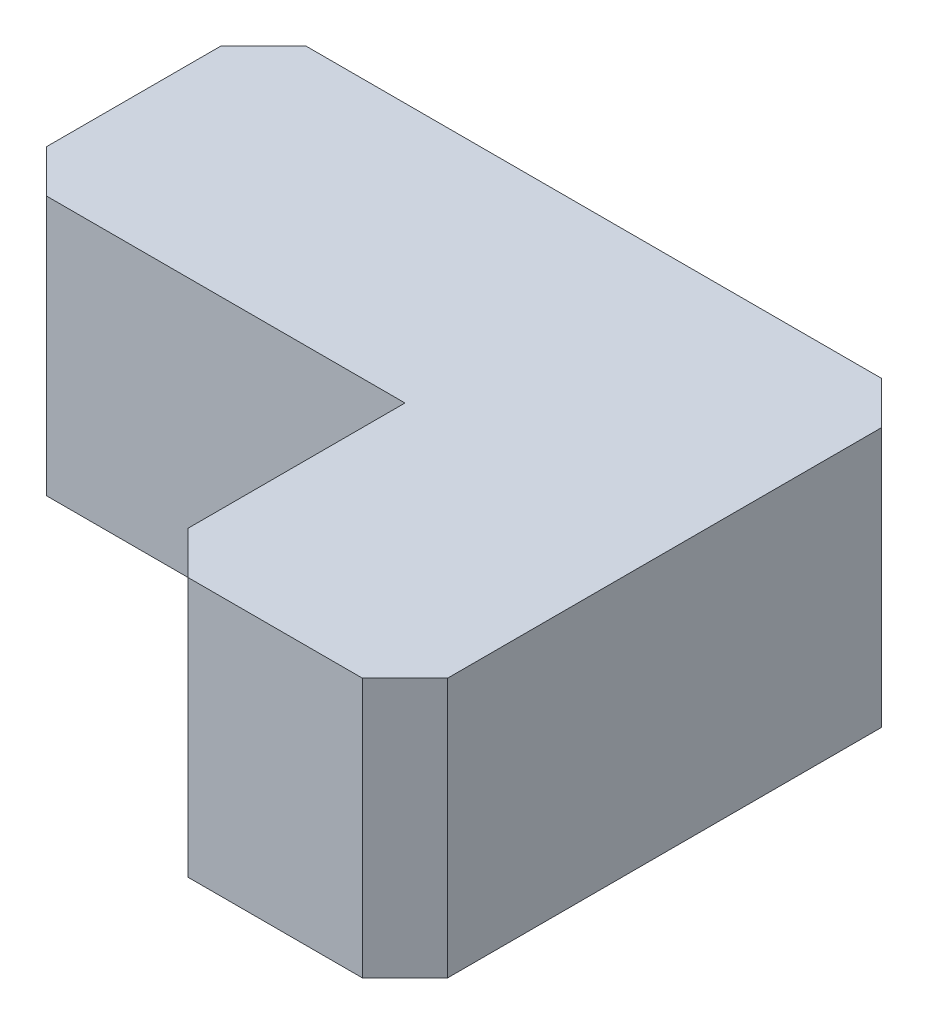
ISO-10303-21;
HEADER;
FILE_DESCRIPTION(('STEP AP214'),'2;1');
FILE_NAME('part.step','',(''),(''),'','','');
FILE_SCHEMA(('AUTOMOTIVE_DESIGN { 1 0 10303 214 1 1 1 1 }'));
ENDSEC;
DATA;
#1=APPLICATION_CONTEXT('core data for automotive mechanical design processes');
#2=APPLICATION_PROTOCOL_DEFINITION('international standard','automotive_design',2000,#1);
#3=PRODUCT_CONTEXT('',#1,'mechanical');
#4=PRODUCT('Part','Part','',(#3));
#5=PRODUCT_RELATED_PRODUCT_CATEGORY('part','',(#4));
#6=PRODUCT_DEFINITION_FORMATION('','',#4);
#7=PRODUCT_DEFINITION_CONTEXT('part definition',#1,'design');
#8=PRODUCT_DEFINITION('design','',#6,#7);
#9=PRODUCT_DEFINITION_SHAPE('','',#8);
#10=(LENGTH_UNIT() NAMED_UNIT(*) SI_UNIT(.MILLI.,.METRE.));
#11=(NAMED_UNIT(*) PLANE_ANGLE_UNIT() SI_UNIT($,.RADIAN.));
#12=(NAMED_UNIT(*) SI_UNIT($,.STERADIAN.) SOLID_ANGLE_UNIT());
#13=UNCERTAINTY_MEASURE_WITH_UNIT(LENGTH_MEASURE(1.E-05),#10,'distance_accuracy_value','');
#14=(GEOMETRIC_REPRESENTATION_CONTEXT(3) GLOBAL_UNCERTAINTY_ASSIGNED_CONTEXT((#13)) GLOBAL_UNIT_ASSIGNED_CONTEXT((#10,
#11,#12)) REPRESENTATION_CONTEXT('',''));
#15=CARTESIAN_POINT('',(0.,0.,0.));
#16=DIRECTION('',(0.,0.,1.));
#17=DIRECTION('',(1.,0.,0.));
#18=AXIS2_PLACEMENT_3D('',#15,#16,#17);
#19=CARTESIAN_POINT('',(9.,55.,0.));
#20=DIRECTION('',(0.,0.,-1.));
#21=DIRECTION('',(-1.,0.,0.));
#22=AXIS2_PLACEMENT_3D('',#19,#20,#21);
#23=PLANE('',#22);
#24=DIRECTION('',(0.,-1.,0.));
#25=VECTOR('',#24,1.);
#26=CARTESIAN_POINT('',(85.,55.,0.));
#27=LINE('',#26,#25);
#28=CARTESIAN_POINT('',(85.,55.,0.));
#29=VERTEX_POINT('',#28);
#30=CARTESIAN_POINT('',(85.,0.,0.));
#31=VERTEX_POINT('',#30);
#32=EDGE_CURVE('E140',#29,#31,#27,.T.);
#33=ORIENTED_EDGE('',*,*,#32,.F.);
#34=DIRECTION('',(1.,0.,0.));
#35=VECTOR('',#34,1.);
#36=CARTESIAN_POINT('',(9.,55.,0.));
#37=LINE('',#36,#35);
#38=CARTESIAN_POINT('',(9.,55.,0.));
#39=VERTEX_POINT('',#38);
#40=EDGE_CURVE('E583',#39,#29,#37,.T.);
#41=ORIENTED_EDGE('',*,*,#40,.F.);
#42=DIRECTION('',(0.,-1.,0.));
#43=VECTOR('',#42,1.);
#44=CARTESIAN_POINT('',(9.,55.,0.));
#45=LINE('',#44,#43);
#46=CARTESIAN_POINT('',(9.,0.,0.));
#47=VERTEX_POINT('',#46);
#48=EDGE_CURVE('E579',#39,#47,#45,.T.);
#49=ORIENTED_EDGE('',*,*,#48,.T.);
#50=DIRECTION('',(1.,0.,0.));
#51=VECTOR('',#50,1.);
#52=CARTESIAN_POINT('',(9.,0.,0.));
#53=LINE('',#52,#51);
#54=EDGE_CURVE('E577',#47,#31,#53,.T.);
#55=ORIENTED_EDGE('',*,*,#54,.T.);
#56=EDGE_LOOP('',(#33,#41,#49,#55));
#57=FACE_BOUND('',#56,.T.);
#58=ADVANCED_FACE('F44',(#57),#23,.F.);
#59=CARTESIAN_POINT('',(140.,55.,0.));
#60=DIRECTION('',(-1.,0.,0.));
#61=DIRECTION('',(0.,0.,1.));
#62=AXIS2_PLACEMENT_3D('',#59,#60,#61);
#63=PLANE('',#62);
#64=DIRECTION('',(0.,0.,-1.));
#65=VECTOR('',#64,1.);
#66=CARTESIAN_POINT('',(140.,0.,0.));
#67=LINE('',#66,#65);
#68=CARTESIAN_POINT('',(140.,0.,46.));
#69=VERTEX_POINT('',#68);
#70=CARTESIAN_POINT('',(140.,0.,-46.));
#71=VERTEX_POINT('',#70);
#72=EDGE_CURVE('E176',#69,#71,#67,.T.);
#73=ORIENTED_EDGE('',*,*,#72,.T.);
#74=DIRECTION('',(0.,-1.,0.));
#75=VECTOR('',#74,1.);
#76=CARTESIAN_POINT('',(140.,55.,-46.));
#77=LINE('',#76,#75);
#78=CARTESIAN_POINT('',(140.,55.,-46.));
#79=VERTEX_POINT('',#78);
#80=EDGE_CURVE('E210',#79,#71,#77,.T.);
#81=ORIENTED_EDGE('',*,*,#80,.F.);
#82=DIRECTION('',(0.,0.,-1.));
#83=VECTOR('',#82,1.);
#84=CARTESIAN_POINT('',(140.,55.,0.));
#85=LINE('',#84,#83);
#86=CARTESIAN_POINT('',(140.,55.,46.));
#87=VERTEX_POINT('',#86);
#88=EDGE_CURVE('E192',#87,#79,#85,.T.);
#89=ORIENTED_EDGE('',*,*,#88,.F.);
#90=DIRECTION('',(0.,-1.,0.));
#91=VECTOR('',#90,1.);
#92=CARTESIAN_POINT('',(140.,55.,46.));
#93=LINE('',#92,#91);
#94=EDGE_CURVE('E189',#87,#69,#93,.T.);
#95=ORIENTED_EDGE('',*,*,#94,.T.);
#96=EDGE_LOOP('',(#73,#81,#89,#95));
#97=FACE_BOUND('',#96,.T.);
#98=ADVANCED_FACE('F190',(#97),#63,.F.);
#99=CARTESIAN_POINT('',(131.,55.,-55.));
#100=DIRECTION('',(0.707106781186547,0.,-0.707106781186548));
#101=DIRECTION('',(-0.707106781186548,0.,-0.707106781186547));
#102=AXIS2_PLACEMENT_3D('',#99,#100,#101);
#103=PLANE('',#102);
#104=DIRECTION('',(0.707106781186548,0.,0.707106781186547));
#105=VECTOR('',#104,1.);
#106=CARTESIAN_POINT('',(131.,0.,-55.));
#107=LINE('',#106,#105);
#108=CARTESIAN_POINT('',(131.,0.,-55.));
#109=VERTEX_POINT('',#108);
#110=EDGE_CURVE('E183',#109,#71,#107,.T.);
#111=ORIENTED_EDGE('',*,*,#110,.F.);
#112=DIRECTION('',(0.,-1.,0.));
#113=VECTOR('',#112,1.);
#114=CARTESIAN_POINT('',(131.,55.,-55.));
#115=LINE('',#114,#113);
#116=CARTESIAN_POINT('',(131.,55.,-55.));
#117=VERTEX_POINT('',#116);
#118=EDGE_CURVE('E557',#117,#109,#115,.T.);
#119=ORIENTED_EDGE('',*,*,#118,.F.);
#120=DIRECTION('',(0.707106781186548,0.,0.707106781186547));
#121=VECTOR('',#120,1.);
#122=CARTESIAN_POINT('',(131.,55.,-55.));
#123=LINE('',#122,#121);
#124=EDGE_CURVE('E626',#117,#79,#123,.T.);
#125=ORIENTED_EDGE('',*,*,#124,.T.);
#126=ORIENTED_EDGE('',*,*,#80,.T.);
#127=EDGE_LOOP('',(#111,#119,#125,#126));
#128=FACE_BOUND('',#127,.T.);
#129=ADVANCED_FACE('F509',(#128),#103,.T.);
#130=CARTESIAN_POINT('',(9.,55.,-55.));
#131=DIRECTION('',(0.,0.,-1.));
#132=DIRECTION('',(-1.,0.,0.));
#133=AXIS2_PLACEMENT_3D('',#130,#131,#132);
#134=PLANE('',#133);
#135=DIRECTION('',(1.,0.,0.));
#136=VECTOR('',#135,1.);
#137=CARTESIAN_POINT('',(9.,0.,-55.));
#138=LINE('',#137,#136);
#139=CARTESIAN_POINT('',(9.,0.,-55.));
#140=VERTEX_POINT('',#139);
#141=EDGE_CURVE('E561',#140,#109,#138,.T.);
#142=ORIENTED_EDGE('',*,*,#141,.F.);
#143=DIRECTION('',(0.,-1.,0.));
#144=VECTOR('',#143,1.);
#145=CARTESIAN_POINT('',(9.,55.,-55.));
#146=LINE('',#145,#144);
#147=CARTESIAN_POINT('',(9.,55.,-55.));
#148=VERTEX_POINT('',#147);
#149=EDGE_CURVE('E589',#148,#140,#146,.T.);
#150=ORIENTED_EDGE('',*,*,#149,.F.);
#151=DIRECTION('',(1.,0.,0.));
#152=VECTOR('',#151,1.);
#153=CARTESIAN_POINT('',(9.,55.,-55.));
#154=LINE('',#153,#152);
#155=EDGE_CURVE('E623',#148,#117,#154,.T.);
#156=ORIENTED_EDGE('',*,*,#155,.T.);
#157=ORIENTED_EDGE('',*,*,#118,.T.);
#158=EDGE_LOOP('',(#142,#150,#156,#157));
#159=FACE_BOUND('',#158,.T.);
#160=ADVANCED_FACE('F500',(#159),#134,.T.);
#161=CARTESIAN_POINT('',(0.,55.,-46.));
#162=DIRECTION('',(-0.707106781186548,0.,-0.707106781186547));
#163=DIRECTION('',(-0.707106781186547,0.,0.707106781186548));
#164=AXIS2_PLACEMENT_3D('',#161,#162,#163);
#165=PLANE('',#164);
#166=DIRECTION('',(0.707106781186547,0.,-0.707106781186548));
#167=VECTOR('',#166,1.);
#168=CARTESIAN_POINT('',(0.,0.,-46.));
#169=LINE('',#168,#167);
#170=CARTESIAN_POINT('',(0.,0.,-46.));
#171=VERTEX_POINT('',#170);
#172=EDGE_CURVE('E567',#171,#140,#169,.T.);
#173=ORIENTED_EDGE('',*,*,#172,.F.);
#174=DIRECTION('',(0.,-1.,0.));
#175=VECTOR('',#174,1.);
#176=CARTESIAN_POINT('',(0.,55.,-46.));
#177=LINE('',#176,#175);
#178=CARTESIAN_POINT('',(0.,55.,-46.));
#179=VERTEX_POINT('',#178);
#180=EDGE_CURVE('E586',#179,#171,#177,.T.);
#181=ORIENTED_EDGE('',*,*,#180,.F.);
#182=DIRECTION('',(0.707106781186547,0.,-0.707106781186548));
#183=VECTOR('',#182,1.);
#184=CARTESIAN_POINT('',(0.,55.,-46.));
#185=LINE('',#184,#183);
#186=EDGE_CURVE('E620',#179,#148,#185,.T.);
#187=ORIENTED_EDGE('',*,*,#186,.T.);
#188=ORIENTED_EDGE('',*,*,#149,.T.);
#189=EDGE_LOOP('',(#173,#181,#187,#188));
#190=FACE_BOUND('',#189,.T.);
#191=ADVANCED_FACE('F491',(#190),#165,.T.);
#192=CARTESIAN_POINT('',(0.,55.,-9.));
#193=DIRECTION('',(-1.,0.,0.));
#194=DIRECTION('',(0.,0.,1.));
#195=AXIS2_PLACEMENT_3D('',#192,#193,#194);
#196=PLANE('',#195);
#197=DIRECTION('',(0.,0.,-1.));
#198=VECTOR('',#197,1.);
#199=CARTESIAN_POINT('',(0.,0.,-9.));
#200=LINE('',#199,#198);
#201=CARTESIAN_POINT('',(0.,0.,-9.));
#202=VERTEX_POINT('',#201);
#203=EDGE_CURVE('E570',#202,#171,#200,.T.);
#204=ORIENTED_EDGE('',*,*,#203,.F.);
#205=DIRECTION('',(0.,-1.,0.));
#206=VECTOR('',#205,1.);
#207=CARTESIAN_POINT('',(0.,55.,-9.));
#208=LINE('',#207,#206);
#209=CARTESIAN_POINT('',(0.,55.,-9.));
#210=VERTEX_POINT('',#209);
#211=EDGE_CURVE('E582',#210,#202,#208,.T.);
#212=ORIENTED_EDGE('',*,*,#211,.F.);
#213=DIRECTION('',(0.,0.,-1.));
#214=VECTOR('',#213,1.);
#215=CARTESIAN_POINT('',(0.,55.,-9.));
#216=LINE('',#215,#214);
#217=EDGE_CURVE('E615',#210,#179,#216,.T.);
#218=ORIENTED_EDGE('',*,*,#217,.T.);
#219=ORIENTED_EDGE('',*,*,#180,.T.);
#220=EDGE_LOOP('',(#204,#212,#218,#219));
#221=FACE_BOUND('',#220,.T.);
#222=ADVANCED_FACE('F482',(#221),#196,.T.);
#223=CARTESIAN_POINT('',(0.,55.,-9.));
#224=DIRECTION('',(0.707106781186547,0.,-0.707106781186547));
#225=DIRECTION('',(-0.707106781186548,0.,-0.707106781186548));
#226=AXIS2_PLACEMENT_3D('',#223,#224,#225);
#227=PLANE('',#226);
#228=DIRECTION('',(0.707106781186547,0.,0.707106781186547));
#229=VECTOR('',#228,1.);
#230=CARTESIAN_POINT('',(0.,0.,-9.));
#231=LINE('',#230,#229);
#232=EDGE_CURVE('E574',#202,#47,#231,.T.);
#233=ORIENTED_EDGE('',*,*,#232,.T.);
#234=ORIENTED_EDGE('',*,*,#48,.F.);
#235=DIRECTION('',(0.707106781186547,0.,0.707106781186547));
#236=VECTOR('',#235,1.);
#237=CARTESIAN_POINT('',(0.,55.,-9.));
#238=LINE('',#237,#236);
#239=EDGE_CURVE('E612',#210,#39,#238,.T.);
#240=ORIENTED_EDGE('',*,*,#239,.F.);
#241=ORIENTED_EDGE('',*,*,#211,.T.);
#242=EDGE_LOOP('',(#233,#234,#240,#241));
#243=FACE_BOUND('',#242,.T.);
#244=ADVANCED_FACE('F473',(#243),#227,.F.);
#245=CARTESIAN_POINT('',(0.,55.,0.));
#246=DIRECTION('',(0.,-1.,0.));
#247=DIRECTION('',(0.,0.,-1.));
#248=AXIS2_PLACEMENT_3D('',#245,#246,#247);
#249=PLANE('',#248);
#250=ORIENTED_EDGE('',*,*,#88,.T.);
#251=ORIENTED_EDGE('',*,*,#124,.F.);
#252=ORIENTED_EDGE('',*,*,#155,.F.);
#253=ORIENTED_EDGE('',*,*,#186,.F.);
#254=ORIENTED_EDGE('',*,*,#217,.F.);
#255=ORIENTED_EDGE('',*,*,#239,.T.);
#256=ORIENTED_EDGE('',*,*,#40,.T.);
#257=DIRECTION('',(0.,0.,1.));
#258=VECTOR('',#257,1.);
#259=CARTESIAN_POINT('',(85.,55.,0.));
#260=LINE('',#259,#258);
#261=CARTESIAN_POINT('',(85.,55.,46.));
#262=VERTEX_POINT('',#261);
#263=EDGE_CURVE('E197',#29,#262,#260,.T.);
#264=ORIENTED_EDGE('',*,*,#263,.T.);
#265=DIRECTION('',(-0.707106781186547,0.,-0.707106781186548));
#266=VECTOR('',#265,1.);
#267=CARTESIAN_POINT('',(94.,55.,55.));
#268=LINE('',#267,#266);
#269=CARTESIAN_POINT('',(94.,55.,55.));
#270=VERTEX_POINT('',#269);
#271=EDGE_CURVE('E200',#270,#262,#268,.T.);
#272=ORIENTED_EDGE('',*,*,#271,.F.);
#273=DIRECTION('',(-1.,0.,0.));
#274=VECTOR('',#273,1.);
#275=CARTESIAN_POINT('',(131.,55.,55.));
#276=LINE('',#275,#274);
#277=CARTESIAN_POINT('',(131.,55.,55.));
#278=VERTEX_POINT('',#277);
#279=EDGE_CURVE('E596',#278,#270,#276,.T.);
#280=ORIENTED_EDGE('',*,*,#279,.F.);
#281=DIRECTION('',(-0.707106781186548,0.,0.707106781186547));
#282=VECTOR('',#281,1.);
#283=CARTESIAN_POINT('',(140.,55.,46.));
#284=LINE('',#283,#282);
#285=EDGE_CURVE('E194',#87,#278,#284,.T.);
#286=ORIENTED_EDGE('',*,*,#285,.F.);
#287=EDGE_LOOP('',(#250,#251,#252,#253,#254,#255,#256,#264,#272,#280,#286));
#288=FACE_BOUND('',#287,.T.);
#289=ADVANCED_FACE('F465',(#288),#249,.F.);
#290=CARTESIAN_POINT('',(0.,0.,0.));
#291=DIRECTION('',(0.,-1.,0.));
#292=DIRECTION('',(0.,0.,-1.));
#293=AXIS2_PLACEMENT_3D('',#290,#291,#292);
#294=PLANE('',#293);
#295=ORIENTED_EDGE('',*,*,#72,.F.);
#296=DIRECTION('',(-0.707106781186548,0.,0.707106781186547));
#297=VECTOR('',#296,1.);
#298=CARTESIAN_POINT('',(140.,0.,46.));
#299=LINE('',#298,#297);
#300=CARTESIAN_POINT('',(131.,0.,55.));
#301=VERTEX_POINT('',#300);
#302=EDGE_CURVE('E180',#69,#301,#299,.T.);
#303=ORIENTED_EDGE('',*,*,#302,.T.);
#304=DIRECTION('',(-1.,0.,0.));
#305=VECTOR('',#304,1.);
#306=CARTESIAN_POINT('',(131.,0.,55.));
#307=LINE('',#306,#305);
#308=CARTESIAN_POINT('',(94.,0.,55.));
#309=VERTEX_POINT('',#308);
#310=EDGE_CURVE('E198',#301,#309,#307,.T.);
#311=ORIENTED_EDGE('',*,*,#310,.T.);
#312=DIRECTION('',(-0.707106781186547,0.,-0.707106781186548));
#313=VECTOR('',#312,1.);
#314=CARTESIAN_POINT('',(94.,0.,55.));
#315=LINE('',#314,#313);
#316=CARTESIAN_POINT('',(85.,0.,46.));
#317=VERTEX_POINT('',#316);
#318=EDGE_CURVE('E202',#309,#317,#315,.T.);
#319=ORIENTED_EDGE('',*,*,#318,.T.);
#320=DIRECTION('',(0.,0.,1.));
#321=VECTOR('',#320,1.);
#322=CARTESIAN_POINT('',(85.,0.,0.));
#323=LINE('',#322,#321);
#324=EDGE_CURVE('E600',#31,#317,#323,.T.);
#325=ORIENTED_EDGE('',*,*,#324,.F.);
#326=ORIENTED_EDGE('',*,*,#54,.F.);
#327=ORIENTED_EDGE('',*,*,#232,.F.);
#328=ORIENTED_EDGE('',*,*,#203,.T.);
#329=ORIENTED_EDGE('',*,*,#172,.T.);
#330=ORIENTED_EDGE('',*,*,#141,.T.);
#331=ORIENTED_EDGE('',*,*,#110,.T.);
#332=EDGE_LOOP('',(#295,#303,#311,#319,#325,#326,#327,#328,#329,#330,#331));
#333=FACE_BOUND('',#332,.T.);
#334=ADVANCED_FACE('F178',(#333),#294,.T.);
#335=CARTESIAN_POINT('',(140.,55.,46.));
#336=DIRECTION('',(0.707106781186547,0.,0.707106781186548));
#337=DIRECTION('',(0.707106781186548,0.,-0.707106781186547));
#338=AXIS2_PLACEMENT_3D('',#335,#336,#337);
#339=PLANE('',#338);
#340=ORIENTED_EDGE('',*,*,#302,.F.);
#341=ORIENTED_EDGE('',*,*,#94,.F.);
#342=ORIENTED_EDGE('',*,*,#285,.T.);
#343=DIRECTION('',(0.,-1.,0.));
#344=VECTOR('',#343,1.);
#345=CARTESIAN_POINT('',(131.,55.,55.));
#346=LINE('',#345,#344);
#347=EDGE_CURVE('E169',#278,#301,#346,.T.);
#348=ORIENTED_EDGE('',*,*,#347,.T.);
#349=EDGE_LOOP('',(#340,#341,#342,#348));
#350=FACE_BOUND('',#349,.T.);
#351=ADVANCED_FACE('F196',(#350),#339,.T.);
#352=CARTESIAN_POINT('',(131.,55.,55.));
#353=DIRECTION('',(0.,0.,1.));
#354=DIRECTION('',(1.,0.,0.));
#355=AXIS2_PLACEMENT_3D('',#352,#353,#354);
#356=PLANE('',#355);
#357=ORIENTED_EDGE('',*,*,#310,.F.);
#358=ORIENTED_EDGE('',*,*,#347,.F.);
#359=ORIENTED_EDGE('',*,*,#279,.T.);
#360=DIRECTION('',(0.,-1.,0.));
#361=VECTOR('',#360,1.);
#362=CARTESIAN_POINT('',(94.,55.,55.));
#363=LINE('',#362,#361);
#364=EDGE_CURVE('E207',#270,#309,#363,.T.);
#365=ORIENTED_EDGE('',*,*,#364,.T.);
#366=EDGE_LOOP('',(#357,#358,#359,#365));
#367=FACE_BOUND('',#366,.T.);
#368=ADVANCED_FACE('F441',(#367),#356,.T.);
#369=CARTESIAN_POINT('',(94.,55.,55.));
#370=DIRECTION('',(-0.707106781186548,0.,0.707106781186547));
#371=DIRECTION('',(0.707106781186547,0.,0.707106781186548));
#372=AXIS2_PLACEMENT_3D('',#369,#370,#371);
#373=PLANE('',#372);
#374=ORIENTED_EDGE('',*,*,#318,.F.);
#375=ORIENTED_EDGE('',*,*,#364,.F.);
#376=ORIENTED_EDGE('',*,*,#271,.T.);
#377=DIRECTION('',(0.,-1.,0.));
#378=VECTOR('',#377,1.);
#379=CARTESIAN_POINT('',(85.,55.,46.));
#380=LINE('',#379,#378);
#381=EDGE_CURVE('E186',#262,#317,#380,.T.);
#382=ORIENTED_EDGE('',*,*,#381,.T.);
#383=EDGE_LOOP('',(#374,#375,#376,#382));
#384=FACE_BOUND('',#383,.T.);
#385=ADVANCED_FACE('F433',(#384),#373,.T.);
#386=CARTESIAN_POINT('',(85.,55.,0.));
#387=DIRECTION('',(1.,0.,0.));
#388=DIRECTION('',(0.,0.,-1.));
#389=AXIS2_PLACEMENT_3D('',#386,#387,#388);
#390=PLANE('',#389);
#391=ORIENTED_EDGE('',*,*,#324,.T.);
#392=ORIENTED_EDGE('',*,*,#381,.F.);
#393=ORIENTED_EDGE('',*,*,#263,.F.);
#394=ORIENTED_EDGE('',*,*,#32,.T.);
#395=EDGE_LOOP('',(#391,#392,#393,#394));
#396=FACE_BOUND('',#395,.T.);
#397=ADVANCED_FACE('F430',(#396),#390,.F.);
#398=CLOSED_SHELL('',(#58,#98,#129,#160,#191,#222,#244,#289,#334,#351,#368,#385,#397));
#399=CARTESIAN_POINT('',(9.,55.,-3.));
#400=DIRECTION('',(0.,0.,-1.));
#401=DIRECTION('',(-1.,0.,0.));
#402=AXIS2_PLACEMENT_3D('',#399,#400,#401);
#403=PLANE('',#402);
#404=DIRECTION('',(0.,-1.,0.));
#405=VECTOR('',#404,1.);
#406=CARTESIAN_POINT('',(88.0000000000001,55.,-3.));
#407=LINE('',#406,#405);
#408=CARTESIAN_POINT('',(88.0000000000001,52.,-3.));
#409=VERTEX_POINT('',#408);
#410=CARTESIAN_POINT('',(88.0000000000001,3.,-3.));
#411=VERTEX_POINT('',#410);
#412=EDGE_CURVE('E11',#409,#411,#407,.T.);
#413=ORIENTED_EDGE('',*,*,#412,.T.);
#414=DIRECTION('',(1.,0.,0.));
#415=VECTOR('',#414,1.);
#416=CARTESIAN_POINT('',(0.,3.,-3.));
#417=LINE('',#416,#415);
#418=CARTESIAN_POINT('',(10.2426406871193,3.,-3.));
#419=VERTEX_POINT('',#418);
#420=EDGE_CURVE('E284',#419,#411,#417,.T.);
#421=ORIENTED_EDGE('',*,*,#420,.F.);
#422=DIRECTION('',(0.,-1.,0.));
#423=VECTOR('',#422,1.);
#424=CARTESIAN_POINT('',(10.2426406871193,55.,-3.));
#425=LINE('',#424,#423);
#426=CARTESIAN_POINT('',(10.2426406871193,52.,-3.));
#427=VERTEX_POINT('',#426);
#428=EDGE_CURVE('E48',#427,#419,#425,.T.);
#429=ORIENTED_EDGE('',*,*,#428,.F.);
#430=DIRECTION('',(1.,0.,0.));
#431=VECTOR('',#430,1.);
#432=CARTESIAN_POINT('',(0.,52.,-3.));
#433=LINE('',#432,#431);
#434=EDGE_CURVE('E251',#427,#409,#433,.T.);
#435=ORIENTED_EDGE('',*,*,#434,.T.);
#436=EDGE_LOOP('',(#413,#421,#429,#435));
#437=FACE_BOUND('',#436,.T.);
#438=ADVANCED_FACE('F295',(#437),#403,.T.);
#439=CARTESIAN_POINT('',(137.,55.,0.));
#440=DIRECTION('',(-1.,0.,0.));
#441=DIRECTION('',(0.,0.,1.));
#442=AXIS2_PLACEMENT_3D('',#439,#440,#441);
#443=PLANE('',#442);
#444=DIRECTION('',(0.,0.,-1.));
#445=VECTOR('',#444,1.);
#446=CARTESIAN_POINT('',(137.,3.,0.));
#447=LINE('',#446,#445);
#448=CARTESIAN_POINT('',(137.,3.,44.7573593128808));
#449=VERTEX_POINT('',#448);
#450=CARTESIAN_POINT('',(137.,3.,-44.7573593128807));
#451=VERTEX_POINT('',#450);
#452=EDGE_CURVE('E282',#449,#451,#447,.T.);
#453=ORIENTED_EDGE('',*,*,#452,.F.);
#454=DIRECTION('',(0.,-1.,0.));
#455=VECTOR('',#454,1.);
#456=CARTESIAN_POINT('',(137.,55.,44.7573593128808));
#457=LINE('',#456,#455);
#458=CARTESIAN_POINT('',(137.,52.,44.7573593128808));
#459=VERTEX_POINT('',#458);
#460=EDGE_CURVE('E279',#459,#449,#457,.T.);
#461=ORIENTED_EDGE('',*,*,#460,.F.);
#462=DIRECTION('',(0.,0.,-1.));
#463=VECTOR('',#462,1.);
#464=CARTESIAN_POINT('',(137.,52.,0.));
#465=LINE('',#464,#463);
#466=CARTESIAN_POINT('',(137.,52.,-44.7573593128807));
#467=VERTEX_POINT('',#466);
#468=EDGE_CURVE('E128',#459,#467,#465,.T.);
#469=ORIENTED_EDGE('',*,*,#468,.T.);
#470=DIRECTION('',(0.,-1.,0.));
#471=VECTOR('',#470,1.);
#472=CARTESIAN_POINT('',(137.,55.,-44.7573593128807));
#473=LINE('',#472,#471);
#474=EDGE_CURVE('E275',#467,#451,#473,.T.);
#475=ORIENTED_EDGE('',*,*,#474,.T.);
#476=EDGE_LOOP('',(#453,#461,#469,#475));
#477=FACE_BOUND('',#476,.T.);
#478=ADVANCED_FACE('F297',(#477),#443,.T.);
#479=CARTESIAN_POINT('',(128.87867965644,55.,-52.8786796564404));
#480=DIRECTION('',(0.707106781186547,0.,-0.707106781186548));
#481=DIRECTION('',(-0.707106781186548,0.,-0.707106781186547));
#482=AXIS2_PLACEMENT_3D('',#479,#480,#481);
#483=PLANE('',#482);
#484=DIRECTION('',(0.707106781186548,0.,0.707106781186547));
#485=VECTOR('',#484,1.);
#486=CARTESIAN_POINT('',(90.8786796564403,3.,-90.8786796564404));
#487=LINE('',#486,#485);
#488=CARTESIAN_POINT('',(129.757359312881,3.,-52.));
#489=VERTEX_POINT('',#488);
#490=EDGE_CURVE('E228',#489,#451,#487,.T.);
#491=ORIENTED_EDGE('',*,*,#490,.T.);
#492=ORIENTED_EDGE('',*,*,#474,.F.);
#493=DIRECTION('',(0.707106781186548,0.,0.707106781186547));
#494=VECTOR('',#493,1.);
#495=CARTESIAN_POINT('',(90.8786796564403,52.,-90.8786796564404));
#496=LINE('',#495,#494);
#497=CARTESIAN_POINT('',(129.757359312881,52.,-52.));
#498=VERTEX_POINT('',#497);
#499=EDGE_CURVE('E277',#498,#467,#496,.T.);
#500=ORIENTED_EDGE('',*,*,#499,.F.);
#501=DIRECTION('',(0.,-1.,0.));
#502=VECTOR('',#501,1.);
#503=CARTESIAN_POINT('',(129.757359312881,55.,-52.));
#504=LINE('',#503,#502);
#505=EDGE_CURVE('E270',#498,#489,#504,.T.);
#506=ORIENTED_EDGE('',*,*,#505,.T.);
#507=EDGE_LOOP('',(#491,#492,#500,#506));
#508=FACE_BOUND('',#507,.T.);
#509=ADVANCED_FACE('F305',(#508),#483,.F.);
#510=CARTESIAN_POINT('',(9.,55.,-52.));
#511=DIRECTION('',(0.,0.,-1.));
#512=DIRECTION('',(-1.,0.,0.));
#513=AXIS2_PLACEMENT_3D('',#510,#511,#512);
#514=PLANE('',#513);
#515=DIRECTION('',(1.,0.,0.));
#516=VECTOR('',#515,1.);
#517=CARTESIAN_POINT('',(0.,3.,-52.));
#518=LINE('',#517,#516);
#519=CARTESIAN_POINT('',(10.2426406871193,3.,-52.));
#520=VERTEX_POINT('',#519);
#521=EDGE_CURVE('E231',#520,#489,#518,.T.);
#522=ORIENTED_EDGE('',*,*,#521,.T.);
#523=ORIENTED_EDGE('',*,*,#505,.F.);
#524=DIRECTION('',(1.,0.,0.));
#525=VECTOR('',#524,1.);
#526=CARTESIAN_POINT('',(0.,52.,-52.));
#527=LINE('',#526,#525);
#528=CARTESIAN_POINT('',(10.2426406871193,52.,-52.));
#529=VERTEX_POINT('',#528);
#530=EDGE_CURVE('E272',#529,#498,#527,.T.);
#531=ORIENTED_EDGE('',*,*,#530,.F.);
#532=DIRECTION('',(0.,-1.,0.));
#533=VECTOR('',#532,1.);
#534=CARTESIAN_POINT('',(10.2426406871193,55.,-52.));
#535=LINE('',#534,#533);
#536=EDGE_CURVE('E265',#529,#520,#535,.T.);
#537=ORIENTED_EDGE('',*,*,#536,.T.);
#538=EDGE_LOOP('',(#522,#523,#531,#537));
#539=FACE_BOUND('',#538,.T.);
#540=ADVANCED_FACE('F335',(#539),#514,.F.);
#541=CARTESIAN_POINT('',(2.12132034355964,55.,-43.8786796564404));
#542=DIRECTION('',(-0.707106781186548,0.,-0.707106781186547));
#543=DIRECTION('',(-0.707106781186547,0.,0.707106781186548));
#544=AXIS2_PLACEMENT_3D('',#541,#542,#543);
#545=PLANE('',#544);
#546=DIRECTION('',(0.707106781186547,0.,-0.707106781186548));
#547=VECTOR('',#546,1.);
#548=CARTESIAN_POINT('',(-20.8786796564404,3.,-20.8786796564404));
#549=LINE('',#548,#547);
#550=CARTESIAN_POINT('',(3.,3.,-44.7573593128807));
#551=VERTEX_POINT('',#550);
#552=EDGE_CURVE('E234',#551,#520,#549,.T.);
#553=ORIENTED_EDGE('',*,*,#552,.T.);
#554=ORIENTED_EDGE('',*,*,#536,.F.);
#555=DIRECTION('',(0.707106781186547,0.,-0.707106781186548));
#556=VECTOR('',#555,1.);
#557=CARTESIAN_POINT('',(-20.8786796564404,52.,-20.8786796564404));
#558=LINE('',#557,#556);
#559=CARTESIAN_POINT('',(3.,52.,-44.7573593128807));
#560=VERTEX_POINT('',#559);
#561=EDGE_CURVE('E267',#560,#529,#558,.T.);
#562=ORIENTED_EDGE('',*,*,#561,.F.);
#563=DIRECTION('',(0.,-1.,0.));
#564=VECTOR('',#563,1.);
#565=CARTESIAN_POINT('',(3.,55.,-44.7573593128807));
#566=LINE('',#565,#564);
#567=EDGE_CURVE('E260',#560,#551,#566,.T.);
#568=ORIENTED_EDGE('',*,*,#567,.T.);
#569=EDGE_LOOP('',(#553,#554,#562,#568));
#570=FACE_BOUND('',#569,.T.);
#571=ADVANCED_FACE('F338',(#570),#545,.F.);
#572=CARTESIAN_POINT('',(3.,55.,-9.));
#573=DIRECTION('',(-1.,0.,0.));
#574=DIRECTION('',(0.,0.,1.));
#575=AXIS2_PLACEMENT_3D('',#572,#573,#574);
#576=PLANE('',#575);
#577=DIRECTION('',(0.,0.,-1.));
#578=VECTOR('',#577,1.);
#579=CARTESIAN_POINT('',(3.,3.,0.));
#580=LINE('',#579,#578);
#581=CARTESIAN_POINT('',(3.,3.,-10.2426406871193));
#582=VERTEX_POINT('',#581);
#583=EDGE_CURVE('E237',#582,#551,#580,.T.);
#584=ORIENTED_EDGE('',*,*,#583,.T.);
#585=ORIENTED_EDGE('',*,*,#567,.F.);
#586=DIRECTION('',(0.,0.,-1.));
#587=VECTOR('',#586,1.);
#588=CARTESIAN_POINT('',(3.,52.,0.));
#589=LINE('',#588,#587);
#590=CARTESIAN_POINT('',(3.,52.,-10.2426406871193));
#591=VERTEX_POINT('',#590);
#592=EDGE_CURVE('E262',#591,#560,#589,.T.);
#593=ORIENTED_EDGE('',*,*,#592,.F.);
#594=DIRECTION('',(0.,-1.,0.));
#595=VECTOR('',#594,1.);
#596=CARTESIAN_POINT('',(3.,55.,-10.2426406871193));
#597=LINE('',#596,#595);
#598=EDGE_CURVE('E256',#591,#582,#597,.T.);
#599=ORIENTED_EDGE('',*,*,#598,.T.);
#600=EDGE_LOOP('',(#584,#585,#593,#599));
#601=FACE_BOUND('',#600,.T.);
#602=ADVANCED_FACE('F342',(#601),#576,.F.);
#603=CARTESIAN_POINT('',(2.12132034355964,55.,-11.1213203435596));
#604=DIRECTION('',(0.707106781186547,0.,-0.707106781186547));
#605=DIRECTION('',(-0.707106781186548,0.,-0.707106781186548));
#606=AXIS2_PLACEMENT_3D('',#603,#604,#605);
#607=PLANE('',#606);
#608=DIRECTION('',(0.707106781186548,0.,0.707106781186548));
#609=VECTOR('',#608,1.);
#610=CARTESIAN_POINT('',(6.62132034355964,3.,-6.62132034355964));
#611=LINE('',#610,#609);
#612=EDGE_CURVE('E258',#582,#419,#611,.T.);
#613=ORIENTED_EDGE('',*,*,#612,.F.);
#614=ORIENTED_EDGE('',*,*,#598,.F.);
#615=DIRECTION('',(0.707106781186548,0.,0.707106781186548));
#616=VECTOR('',#615,1.);
#617=CARTESIAN_POINT('',(6.62132034355964,52.,-6.62132034355964));
#618=LINE('',#617,#616);
#619=EDGE_CURVE('E253',#591,#427,#618,.T.);
#620=ORIENTED_EDGE('',*,*,#619,.T.);
#621=ORIENTED_EDGE('',*,*,#428,.T.);
#622=EDGE_LOOP('',(#613,#614,#620,#621));
#623=FACE_BOUND('',#622,.T.);
#624=ADVANCED_FACE('F291',(#623),#607,.T.);
#625=CARTESIAN_POINT('',(0.,52.,0.));
#626=DIRECTION('',(0.,-1.,0.));
#627=DIRECTION('',(0.,0.,-1.));
#628=AXIS2_PLACEMENT_3D('',#625,#626,#627);
#629=PLANE('',#628);
#630=ORIENTED_EDGE('',*,*,#468,.F.);
#631=DIRECTION('',(-0.707106781186548,0.,0.707106781186547));
#632=VECTOR('',#631,1.);
#633=CARTESIAN_POINT('',(90.8786796564403,52.,90.8786796564404));
#634=LINE('',#633,#632);
#635=CARTESIAN_POINT('',(129.757359312881,52.,52.));
#636=VERTEX_POINT('',#635);
#637=EDGE_CURVE('E226',#459,#636,#634,.T.);
#638=ORIENTED_EDGE('',*,*,#637,.T.);
#639=DIRECTION('',(-1.,0.,0.));
#640=VECTOR('',#639,1.);
#641=CARTESIAN_POINT('',(0.,52.,52.));
#642=LINE('',#641,#640);
#643=CARTESIAN_POINT('',(95.2426406871193,52.,52.));
#644=VERTEX_POINT('',#643);
#645=EDGE_CURVE('E221',#636,#644,#642,.T.);
#646=ORIENTED_EDGE('',*,*,#645,.T.);
#647=DIRECTION('',(-0.707106781186547,0.,-0.707106781186548));
#648=VECTOR('',#647,1.);
#649=CARTESIAN_POINT('',(21.6213203435597,52.,-21.6213203435597));
#650=LINE('',#649,#648);
#651=CARTESIAN_POINT('',(88.0000000000001,52.,44.7573593128807));
#652=VERTEX_POINT('',#651);
#653=EDGE_CURVE('E216',#644,#652,#650,.T.);
#654=ORIENTED_EDGE('',*,*,#653,.T.);
#655=DIRECTION('',(0.,0.,1.));
#656=VECTOR('',#655,1.);
#657=CARTESIAN_POINT('',(88.0000000000001,52.,0.));
#658=LINE('',#657,#656);
#659=EDGE_CURVE('E249',#409,#652,#658,.T.);
#660=ORIENTED_EDGE('',*,*,#659,.F.);
#661=ORIENTED_EDGE('',*,*,#434,.F.);
#662=ORIENTED_EDGE('',*,*,#619,.F.);
#663=ORIENTED_EDGE('',*,*,#592,.T.);
#664=ORIENTED_EDGE('',*,*,#561,.T.);
#665=ORIENTED_EDGE('',*,*,#530,.T.);
#666=ORIENTED_EDGE('',*,*,#499,.T.);
#667=EDGE_LOOP('',(#630,#638,#646,#654,#660,#661,#662,#663,#664,#665,#666));
#668=FACE_BOUND('',#667,.T.);
#669=ADVANCED_FACE('F343',(#668),#629,.T.);
#670=CARTESIAN_POINT('',(0.,3.,0.));
#671=DIRECTION('',(0.,-1.,0.));
#672=DIRECTION('',(0.,0.,-1.));
#673=AXIS2_PLACEMENT_3D('',#670,#671,#672);
#674=PLANE('',#673);
#675=ORIENTED_EDGE('',*,*,#452,.T.);
#676=ORIENTED_EDGE('',*,*,#490,.F.);
#677=ORIENTED_EDGE('',*,*,#521,.F.);
#678=ORIENTED_EDGE('',*,*,#552,.F.);
#679=ORIENTED_EDGE('',*,*,#583,.F.);
#680=ORIENTED_EDGE('',*,*,#612,.T.);
#681=ORIENTED_EDGE('',*,*,#420,.T.);
#682=DIRECTION('',(0.,0.,1.));
#683=VECTOR('',#682,1.);
#684=CARTESIAN_POINT('',(88.0000000000001,3.,0.));
#685=LINE('',#684,#683);
#686=CARTESIAN_POINT('',(88.0000000000001,3.,44.7573593128807));
#687=VERTEX_POINT('',#686);
#688=EDGE_CURVE('E55',#411,#687,#685,.T.);
#689=ORIENTED_EDGE('',*,*,#688,.T.);
#690=DIRECTION('',(-0.707106781186547,0.,-0.707106781186548));
#691=VECTOR('',#690,1.);
#692=CARTESIAN_POINT('',(21.6213203435597,3.,-21.6213203435597));
#693=LINE('',#692,#691);
#694=CARTESIAN_POINT('',(95.2426406871193,3.,52.));
#695=VERTEX_POINT('',#694);
#696=EDGE_CURVE('E240',#695,#687,#693,.T.);
#697=ORIENTED_EDGE('',*,*,#696,.F.);
#698=DIRECTION('',(-1.,0.,0.));
#699=VECTOR('',#698,1.);
#700=CARTESIAN_POINT('',(0.,3.,52.));
#701=LINE('',#700,#699);
#702=CARTESIAN_POINT('',(129.757359312881,3.,52.));
#703=VERTEX_POINT('',#702);
#704=EDGE_CURVE('E243',#703,#695,#701,.T.);
#705=ORIENTED_EDGE('',*,*,#704,.F.);
#706=DIRECTION('',(-0.707106781186548,0.,0.707106781186547));
#707=VECTOR('',#706,1.);
#708=CARTESIAN_POINT('',(90.8786796564403,3.,90.8786796564404));
#709=LINE('',#708,#707);
#710=EDGE_CURVE('E246',#449,#703,#709,.T.);
#711=ORIENTED_EDGE('',*,*,#710,.F.);
#712=EDGE_LOOP('',(#675,#676,#677,#678,#679,#680,#681,#689,#697,#705,#711));
#713=FACE_BOUND('',#712,.T.);
#714=ADVANCED_FACE('F311',(#713),#674,.F.);
#715=CARTESIAN_POINT('',(137.87867965644,55.,43.8786796564404));
#716=DIRECTION('',(0.707106781186547,0.,0.707106781186548));
#717=DIRECTION('',(0.707106781186548,0.,-0.707106781186547));
#718=AXIS2_PLACEMENT_3D('',#715,#716,#717);
#719=PLANE('',#718);
#720=ORIENTED_EDGE('',*,*,#710,.T.);
#721=DIRECTION('',(0.,-1.,0.));
#722=VECTOR('',#721,1.);
#723=CARTESIAN_POINT('',(129.757359312881,55.,52.));
#724=LINE('',#723,#722);
#725=EDGE_CURVE('E224',#636,#703,#724,.T.);
#726=ORIENTED_EDGE('',*,*,#725,.F.);
#727=ORIENTED_EDGE('',*,*,#637,.F.);
#728=ORIENTED_EDGE('',*,*,#460,.T.);
#729=EDGE_LOOP('',(#720,#726,#727,#728));
#730=FACE_BOUND('',#729,.T.);
#731=ADVANCED_FACE('F299',(#730),#719,.F.);
#732=CARTESIAN_POINT('',(131.,55.,52.));
#733=DIRECTION('',(0.,0.,1.));
#734=DIRECTION('',(1.,0.,0.));
#735=AXIS2_PLACEMENT_3D('',#732,#733,#734);
#736=PLANE('',#735);
#737=ORIENTED_EDGE('',*,*,#704,.T.);
#738=DIRECTION('',(0.,-1.,0.));
#739=VECTOR('',#738,1.);
#740=CARTESIAN_POINT('',(95.2426406871193,55.,52.));
#741=LINE('',#740,#739);
#742=EDGE_CURVE('E219',#644,#695,#741,.T.);
#743=ORIENTED_EDGE('',*,*,#742,.F.);
#744=ORIENTED_EDGE('',*,*,#645,.F.);
#745=ORIENTED_EDGE('',*,*,#725,.T.);
#746=EDGE_LOOP('',(#737,#743,#744,#745));
#747=FACE_BOUND('',#746,.T.);
#748=ADVANCED_FACE('F310',(#747),#736,.F.);
#749=CARTESIAN_POINT('',(96.1213203435597,55.,52.8786796564404));
#750=DIRECTION('',(-0.707106781186548,0.,0.707106781186547));
#751=DIRECTION('',(0.707106781186547,0.,0.707106781186548));
#752=AXIS2_PLACEMENT_3D('',#749,#750,#751);
#753=PLANE('',#752);
#754=ORIENTED_EDGE('',*,*,#696,.T.);
#755=DIRECTION('',(0.,-1.,0.));
#756=VECTOR('',#755,1.);
#757=CARTESIAN_POINT('',(88.0000000000001,55.,44.7573593128807));
#758=LINE('',#757,#756);
#759=EDGE_CURVE('E214',#652,#687,#758,.T.);
#760=ORIENTED_EDGE('',*,*,#759,.F.);
#761=ORIENTED_EDGE('',*,*,#653,.F.);
#762=ORIENTED_EDGE('',*,*,#742,.T.);
#763=EDGE_LOOP('',(#754,#760,#761,#762));
#764=FACE_BOUND('',#763,.T.);
#765=ADVANCED_FACE('F315',(#764),#753,.F.);
#766=CARTESIAN_POINT('',(88.0000000000001,55.,0.));
#767=DIRECTION('',(1.,0.,0.));
#768=DIRECTION('',(0.,0.,-1.));
#769=AXIS2_PLACEMENT_3D('',#766,#767,#768);
#770=PLANE('',#769);
#771=ORIENTED_EDGE('',*,*,#688,.F.);
#772=ORIENTED_EDGE('',*,*,#412,.F.);
#773=ORIENTED_EDGE('',*,*,#659,.T.);
#774=ORIENTED_EDGE('',*,*,#759,.T.);
#775=EDGE_LOOP('',(#771,#772,#773,#774));
#776=FACE_BOUND('',#775,.T.);
#777=ADVANCED_FACE('F46',(#776),#770,.T.);
#778=CLOSED_SHELL('',(#438,#478,#509,#540,#571,#602,#624,#669,#714,#731,#748,#765,#777));
#779=ORIENTED_CLOSED_SHELL('',*,#778,.T.);
#780=BREP_WITH_VOIDS('B2',#398,(#779));
#781=ADVANCED_BREP_SHAPE_REPRESENTATION('',(#18,#780),#14);
#782=SHAPE_DEFINITION_REPRESENTATION(#9,#781);
ENDSEC;
END-ISO-10303-21;
